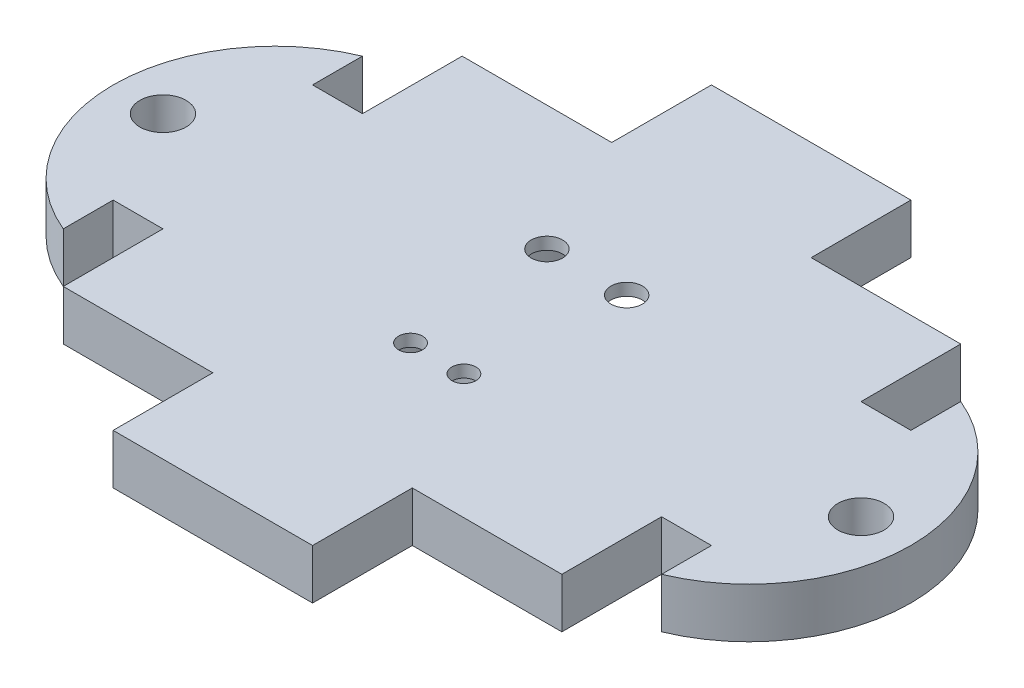
ISO-10303-21;
HEADER;
FILE_DESCRIPTION(('STEP AP214'),'2;1');
FILE_NAME('part.step','',(''),(''),'','','');
FILE_SCHEMA(('AUTOMOTIVE_DESIGN { 1 0 10303 214 1 1 1 1 }'));
ENDSEC;
DATA;
#1=APPLICATION_CONTEXT('core data for automotive mechanical design processes');
#2=APPLICATION_PROTOCOL_DEFINITION('international standard','automotive_design',2000,#1);
#3=PRODUCT_CONTEXT('',#1,'mechanical');
#4=PRODUCT('Part','Part','',(#3));
#5=PRODUCT_RELATED_PRODUCT_CATEGORY('part','',(#4));
#6=PRODUCT_DEFINITION_FORMATION('','',#4);
#7=PRODUCT_DEFINITION_CONTEXT('part definition',#1,'design');
#8=PRODUCT_DEFINITION('design','',#6,#7);
#9=PRODUCT_DEFINITION_SHAPE('','',#8);
#10=(LENGTH_UNIT() NAMED_UNIT(*) SI_UNIT(.MILLI.,.METRE.));
#11=(NAMED_UNIT(*) PLANE_ANGLE_UNIT() SI_UNIT($,.RADIAN.));
#12=(NAMED_UNIT(*) SI_UNIT($,.STERADIAN.) SOLID_ANGLE_UNIT());
#13=UNCERTAINTY_MEASURE_WITH_UNIT(LENGTH_MEASURE(1.E-05),#10,'distance_accuracy_value','');
#14=(GEOMETRIC_REPRESENTATION_CONTEXT(3) GLOBAL_UNCERTAINTY_ASSIGNED_CONTEXT((#13)) GLOBAL_UNIT_ASSIGNED_CONTEXT((#10,
#11,#12)) REPRESENTATION_CONTEXT('',''));
#15=CARTESIAN_POINT('',(0.,0.,0.));
#16=DIRECTION('',(0.,0.,1.));
#17=DIRECTION('',(1.,0.,0.));
#18=AXIS2_PLACEMENT_3D('',#15,#16,#17);
#19=CARTESIAN_POINT('',(15.08125,0.,0.));
#20=DIRECTION('',(0.,-1.,0.));
#21=DIRECTION('',(0.,0.,-1.));
#22=AXIS2_PLACEMENT_3D('',#19,#20,#21);
#23=PLANE('',#22);
#24=CARTESIAN_POINT('',(0.,0.,4.7625));
#25=DIRECTION('',(0.,1.,0.));
#26=DIRECTION('',(0.,0.,1.));
#27=AXIS2_PLACEMENT_3D('',#24,#25,#26);
#28=CIRCLE('',#27,2.6035);
#29=CARTESIAN_POINT('',(0.,0.,7.366));
#30=VERTEX_POINT('',#29);
#31=EDGE_CURVE('E477',#30,#30,#28,.T.);
#32=ORIENTED_EDGE('',*,*,#31,.T.);
#33=EDGE_LOOP('',(#32));
#34=FACE_BOUND('',#33,.T.);
#35=CARTESIAN_POINT('',(22.225,0.,0.));
#36=DIRECTION('',(0.,-1.,0.));
#37=DIRECTION('',(0.,0.,-1.));
#38=AXIS2_PLACEMENT_3D('',#35,#36,#37);
#39=CIRCLE('',#38,1.47319999999999);
#40=CARTESIAN_POINT('',(22.225,0.,-1.47319999999999));
#41=VERTEX_POINT('',#40);
#42=EDGE_CURVE('E508',#41,#41,#39,.T.);
#43=ORIENTED_EDGE('',*,*,#42,.F.);
#44=EDGE_LOOP('',(#43));
#45=FACE_BOUND('',#44,.T.);
#46=CARTESIAN_POINT('',(-22.225,0.,0.));
#47=DIRECTION('',(0.,-1.,0.));
#48=DIRECTION('',(0.,0.,-1.));
#49=AXIS2_PLACEMENT_3D('',#46,#47,#48);
#50=CIRCLE('',#49,1.47319999999999);
#51=CARTESIAN_POINT('',(-22.225,0.,-1.47319999999999));
#52=VERTEX_POINT('',#51);
#53=EDGE_CURVE('E237',#52,#52,#50,.T.);
#54=ORIENTED_EDGE('',*,*,#53,.F.);
#55=EDGE_LOOP('',(#54));
#56=FACE_BOUND('',#55,.T.);
#57=DIRECTION('',(1.,0.,0.));
#58=VECTOR('',#57,1.);
#59=CARTESIAN_POINT('',(6.34999999999999,0.,12.7));
#60=LINE('',#59,#58);
#61=CARTESIAN_POINT('',(6.34999999999999,0.,12.7));
#62=VERTEX_POINT('',#61);
#63=CARTESIAN_POINT('',(15.875,0.,12.7));
#64=VERTEX_POINT('',#63);
#65=EDGE_CURVE('E233',#62,#64,#60,.T.);
#66=ORIENTED_EDGE('',*,*,#65,.F.);
#67=DIRECTION('',(0.,0.,-1.));
#68=VECTOR('',#67,1.);
#69=CARTESIAN_POINT('',(6.34999999999999,0.,12.7));
#70=LINE('',#69,#68);
#71=CARTESIAN_POINT('',(6.35,0.,19.05));
#72=VERTEX_POINT('',#71);
#73=EDGE_CURVE('E139',#72,#62,#70,.T.);
#74=ORIENTED_EDGE('',*,*,#73,.F.);
#75=DIRECTION('',(1.,0.,0.));
#76=VECTOR('',#75,1.);
#77=CARTESIAN_POINT('',(-6.34999999999999,0.,19.05));
#78=LINE('',#77,#76);
#79=CARTESIAN_POINT('',(-6.34999999999999,0.,19.05));
#80=VERTEX_POINT('',#79);
#81=EDGE_CURVE('E133',#80,#72,#78,.T.);
#82=ORIENTED_EDGE('',*,*,#81,.F.);
#83=DIRECTION('',(0.,0.,1.));
#84=VECTOR('',#83,1.);
#85=CARTESIAN_POINT('',(-6.34999999999999,0.,12.7));
#86=LINE('',#85,#84);
#87=CARTESIAN_POINT('',(-6.34999999999999,0.,12.7));
#88=VERTEX_POINT('',#87);
#89=EDGE_CURVE('E223',#88,#80,#86,.T.);
#90=ORIENTED_EDGE('',*,*,#89,.F.);
#91=DIRECTION('',(1.,0.,0.));
#92=VECTOR('',#91,1.);
#93=CARTESIAN_POINT('',(-15.875,0.,12.7));
#94=LINE('',#93,#92);
#95=CARTESIAN_POINT('',(-15.875,0.,12.7));
#96=VERTEX_POINT('',#95);
#97=EDGE_CURVE('E275',#96,#88,#94,.T.);
#98=ORIENTED_EDGE('',*,*,#97,.F.);
#99=DIRECTION('',(0.,0.,1.));
#100=VECTOR('',#99,1.);
#101=CARTESIAN_POINT('',(-15.875,0.,6.35));
#102=LINE('',#101,#100);
#103=CARTESIAN_POINT('',(-15.875,0.,6.35));
#104=VERTEX_POINT('',#103);
#105=EDGE_CURVE('E273',#104,#96,#102,.T.);
#106=ORIENTED_EDGE('',*,*,#105,.F.);
#107=DIRECTION('',(1.,0.,0.));
#108=VECTOR('',#107,1.);
#109=CARTESIAN_POINT('',(-15.875,0.,6.35));
#110=LINE('',#109,#108);
#111=CARTESIAN_POINT('',(-19.05,0.,6.35));
#112=VERTEX_POINT('',#111);
#113=EDGE_CURVE('E271',#112,#104,#110,.T.);
#114=ORIENTED_EDGE('',*,*,#113,.F.);
#115=DIRECTION('',(0.,0.,-1.));
#116=VECTOR('',#115,1.);
#117=CARTESIAN_POINT('',(-19.05,0.,6.35));
#118=LINE('',#117,#116);
#119=CARTESIAN_POINT('',(-19.05,0.,9.525));
#120=VERTEX_POINT('',#119);
#121=EDGE_CURVE('E269',#120,#112,#118,.T.);
#122=ORIENTED_EDGE('',*,*,#121,.F.);
#123=CARTESIAN_POINT('',(-15.08125,0.,0.));
#124=DIRECTION('',(0.,1.,0.));
#125=DIRECTION('',(0.,0.,1.));
#126=AXIS2_PLACEMENT_3D('',#123,#124,#125);
#127=CIRCLE('',#126,10.31875);
#128=CARTESIAN_POINT('',(-19.05,0.,-9.525));
#129=VERTEX_POINT('',#128);
#130=EDGE_CURVE('E267',#129,#120,#127,.T.);
#131=ORIENTED_EDGE('',*,*,#130,.F.);
#132=DIRECTION('',(0.,0.,-1.));
#133=VECTOR('',#132,1.);
#134=CARTESIAN_POINT('',(-19.05,0.,-6.35));
#135=LINE('',#134,#133);
#136=CARTESIAN_POINT('',(-19.05,0.,-6.35));
#137=VERTEX_POINT('',#136);
#138=EDGE_CURVE('E265',#137,#129,#135,.T.);
#139=ORIENTED_EDGE('',*,*,#138,.F.);
#140=DIRECTION('',(-1.,0.,0.));
#141=VECTOR('',#140,1.);
#142=CARTESIAN_POINT('',(-15.875,0.,-6.35));
#143=LINE('',#142,#141);
#144=CARTESIAN_POINT('',(-15.875,0.,-6.35));
#145=VERTEX_POINT('',#144);
#146=EDGE_CURVE('E263',#145,#137,#143,.T.);
#147=ORIENTED_EDGE('',*,*,#146,.F.);
#148=DIRECTION('',(0.,0.,1.));
#149=VECTOR('',#148,1.);
#150=CARTESIAN_POINT('',(-15.875,0.,-12.7));
#151=LINE('',#150,#149);
#152=CARTESIAN_POINT('',(-15.875,0.,-12.7));
#153=VERTEX_POINT('',#152);
#154=EDGE_CURVE('E261',#153,#145,#151,.T.);
#155=ORIENTED_EDGE('',*,*,#154,.F.);
#156=DIRECTION('',(-1.,0.,0.));
#157=VECTOR('',#156,1.);
#158=CARTESIAN_POINT('',(-15.875,0.,-12.7));
#159=LINE('',#158,#157);
#160=CARTESIAN_POINT('',(-6.34999999999999,0.,-12.7));
#161=VERTEX_POINT('',#160);
#162=EDGE_CURVE('E259',#161,#153,#159,.T.);
#163=ORIENTED_EDGE('',*,*,#162,.F.);
#164=DIRECTION('',(0.,0.,1.));
#165=VECTOR('',#164,1.);
#166=CARTESIAN_POINT('',(-6.34999999999999,0.,-12.7));
#167=LINE('',#166,#165);
#168=CARTESIAN_POINT('',(-6.34999999999999,0.,-19.05));
#169=VERTEX_POINT('',#168);
#170=EDGE_CURVE('E257',#169,#161,#167,.T.);
#171=ORIENTED_EDGE('',*,*,#170,.F.);
#172=DIRECTION('',(-1.,0.,0.));
#173=VECTOR('',#172,1.);
#174=CARTESIAN_POINT('',(-6.34999999999999,0.,-19.05));
#175=LINE('',#174,#173);
#176=CARTESIAN_POINT('',(6.35,0.,-19.05));
#177=VERTEX_POINT('',#176);
#178=EDGE_CURVE('E255',#177,#169,#175,.T.);
#179=ORIENTED_EDGE('',*,*,#178,.F.);
#180=DIRECTION('',(0.,0.,-1.));
#181=VECTOR('',#180,1.);
#182=CARTESIAN_POINT('',(6.34999999999999,0.,-12.7));
#183=LINE('',#182,#181);
#184=CARTESIAN_POINT('',(6.34999999999999,0.,-12.7));
#185=VERTEX_POINT('',#184);
#186=EDGE_CURVE('E253',#185,#177,#183,.T.);
#187=ORIENTED_EDGE('',*,*,#186,.F.);
#188=DIRECTION('',(-1.,0.,0.));
#189=VECTOR('',#188,1.);
#190=CARTESIAN_POINT('',(6.34999999999999,0.,-12.7));
#191=LINE('',#190,#189);
#192=CARTESIAN_POINT('',(15.875,0.,-12.7));
#193=VERTEX_POINT('',#192);
#194=EDGE_CURVE('E251',#193,#185,#191,.T.);
#195=ORIENTED_EDGE('',*,*,#194,.F.);
#196=DIRECTION('',(0.,0.,-1.));
#197=VECTOR('',#196,1.);
#198=CARTESIAN_POINT('',(15.875,0.,-12.7));
#199=LINE('',#198,#197);
#200=CARTESIAN_POINT('',(15.875,0.,-6.35));
#201=VERTEX_POINT('',#200);
#202=EDGE_CURVE('E249',#201,#193,#199,.T.);
#203=ORIENTED_EDGE('',*,*,#202,.F.);
#204=DIRECTION('',(-1.,0.,0.));
#205=VECTOR('',#204,1.);
#206=CARTESIAN_POINT('',(15.875,0.,-6.35));
#207=LINE('',#206,#205);
#208=CARTESIAN_POINT('',(19.05,0.,-6.35));
#209=VERTEX_POINT('',#208);
#210=EDGE_CURVE('E247',#209,#201,#207,.T.);
#211=ORIENTED_EDGE('',*,*,#210,.F.);
#212=DIRECTION('',(0.,0.,1.));
#213=VECTOR('',#212,1.);
#214=CARTESIAN_POINT('',(19.05,0.,-6.35));
#215=LINE('',#214,#213);
#216=CARTESIAN_POINT('',(19.05,0.,-9.525));
#217=VERTEX_POINT('',#216);
#218=EDGE_CURVE('E245',#217,#209,#215,.T.);
#219=ORIENTED_EDGE('',*,*,#218,.F.);
#220=CARTESIAN_POINT('',(15.08125,0.,0.));
#221=DIRECTION('',(0.,1.,0.));
#222=DIRECTION('',(0.,0.,-1.));
#223=AXIS2_PLACEMENT_3D('',#220,#221,#222);
#224=CIRCLE('',#223,10.31875);
#225=CARTESIAN_POINT('',(19.05,0.,9.525));
#226=VERTEX_POINT('',#225);
#227=EDGE_CURVE('E243',#226,#217,#224,.T.);
#228=ORIENTED_EDGE('',*,*,#227,.F.);
#229=DIRECTION('',(0.,0.,1.));
#230=VECTOR('',#229,1.);
#231=CARTESIAN_POINT('',(19.05,0.,6.35));
#232=LINE('',#231,#230);
#233=CARTESIAN_POINT('',(19.05,0.,6.35));
#234=VERTEX_POINT('',#233);
#235=EDGE_CURVE('E241',#234,#226,#232,.T.);
#236=ORIENTED_EDGE('',*,*,#235,.F.);
#237=DIRECTION('',(1.,0.,0.));
#238=VECTOR('',#237,1.);
#239=CARTESIAN_POINT('',(15.875,0.,6.35));
#240=LINE('',#239,#238);
#241=CARTESIAN_POINT('',(15.875,0.,6.35));
#242=VERTEX_POINT('',#241);
#243=EDGE_CURVE('E239',#242,#234,#240,.T.);
#244=ORIENTED_EDGE('',*,*,#243,.F.);
#245=DIRECTION('',(0.,0.,-1.));
#246=VECTOR('',#245,1.);
#247=CARTESIAN_POINT('',(15.875,0.,6.35));
#248=LINE('',#247,#246);
#249=EDGE_CURVE('E236',#64,#242,#248,.T.);
#250=ORIENTED_EDGE('',*,*,#249,.F.);
#251=EDGE_LOOP('',(#66,#74,#82,#90,#98,#106,#114,#122,#131,#139,#147,#155,#163,#171,#179,#187,
#195,#203,#211,#219,#228,#236,#244,#250));
#252=FACE_BOUND('',#251,.T.);
#253=CARTESIAN_POINT('',(0.,0.,-4.7625));
#254=DIRECTION('',(0.,1.,0.));
#255=DIRECTION('',(0.,0.,1.));
#256=AXIS2_PLACEMENT_3D('',#253,#254,#255);
#257=CIRCLE('',#256,5.08);
#258=CARTESIAN_POINT('',(0.,0.,0.3175));
#259=VERTEX_POINT('',#258);
#260=EDGE_CURVE('E472',#259,#259,#257,.T.);
#261=ORIENTED_EDGE('',*,*,#260,.T.);
#262=EDGE_LOOP('',(#261));
#263=FACE_BOUND('',#262,.T.);
#264=ADVANCED_FACE('F39',(#34,#45,#56,#252,#263),#23,.T.);
#265=CARTESIAN_POINT('',(15.08125,3.175,0.));
#266=DIRECTION('',(0.,-1.,0.));
#267=DIRECTION('',(0.,0.,-1.));
#268=AXIS2_PLACEMENT_3D('',#265,#266,#267);
#269=PLANE('',#268);
#270=CARTESIAN_POINT('',(2.54,3.175,-4.7625));
#271=DIRECTION('',(0.,-1.,0.));
#272=DIRECTION('',(0.,0.,-1.));
#273=AXIS2_PLACEMENT_3D('',#270,#271,#272);
#274=CIRCLE('',#273,1.);
#275=CARTESIAN_POINT('',(2.54,3.175,-5.7625));
#276=VERTEX_POINT('',#275);
#277=EDGE_CURVE('E496',#276,#276,#274,.T.);
#278=ORIENTED_EDGE('',*,*,#277,.T.);
#279=EDGE_LOOP('',(#278));
#280=FACE_BOUND('',#279,.T.);
#281=CARTESIAN_POINT('',(-1.7,3.175,4.7625));
#282=DIRECTION('',(0.,-1.,0.));
#283=DIRECTION('',(0.,0.,-1.));
#284=AXIS2_PLACEMENT_3D('',#281,#282,#283);
#285=CIRCLE('',#284,0.762);
#286=CARTESIAN_POINT('',(-1.7,3.175,4.0005));
#287=VERTEX_POINT('',#286);
#288=EDGE_CURVE('E502',#287,#287,#285,.T.);
#289=ORIENTED_EDGE('',*,*,#288,.T.);
#290=EDGE_LOOP('',(#289));
#291=FACE_BOUND('',#290,.T.);
#292=CARTESIAN_POINT('',(22.225,3.175,0.));
#293=DIRECTION('',(0.,1.,0.));
#294=DIRECTION('',(0.,0.,1.));
#295=AXIS2_PLACEMENT_3D('',#292,#293,#294);
#296=CIRCLE('',#295,1.47319999999999);
#297=CARTESIAN_POINT('',(22.225,3.175,1.47319999999999));
#298=VERTEX_POINT('',#297);
#299=EDGE_CURVE('E505',#298,#298,#296,.T.);
#300=ORIENTED_EDGE('',*,*,#299,.F.);
#301=EDGE_LOOP('',(#300));
#302=FACE_BOUND('',#301,.T.);
#303=CARTESIAN_POINT('',(-22.225,3.175,0.));
#304=DIRECTION('',(0.,1.,0.));
#305=DIRECTION('',(0.,0.,1.));
#306=AXIS2_PLACEMENT_3D('',#303,#304,#305);
#307=CIRCLE('',#306,1.47319999999999);
#308=CARTESIAN_POINT('',(-22.225,3.175,1.47319999999999));
#309=VERTEX_POINT('',#308);
#310=EDGE_CURVE('E511',#309,#309,#307,.T.);
#311=ORIENTED_EDGE('',*,*,#310,.F.);
#312=EDGE_LOOP('',(#311));
#313=FACE_BOUND('',#312,.T.);
#314=DIRECTION('',(1.,0.,0.));
#315=VECTOR('',#314,1.);
#316=CARTESIAN_POINT('',(6.34999999999999,3.175,12.7));
#317=LINE('',#316,#315);
#318=CARTESIAN_POINT('',(6.34999999999999,3.175,12.7));
#319=VERTEX_POINT('',#318);
#320=CARTESIAN_POINT('',(15.875,3.175,12.7));
#321=VERTEX_POINT('',#320);
#322=EDGE_CURVE('E280',#319,#321,#317,.T.);
#323=ORIENTED_EDGE('',*,*,#322,.T.);
#324=DIRECTION('',(0.,0.,-1.));
#325=VECTOR('',#324,1.);
#326=CARTESIAN_POINT('',(15.875,3.175,6.35));
#327=LINE('',#326,#325);
#328=CARTESIAN_POINT('',(15.875,3.175,6.35));
#329=VERTEX_POINT('',#328);
#330=EDGE_CURVE('E147',#321,#329,#327,.T.);
#331=ORIENTED_EDGE('',*,*,#330,.T.);
#332=DIRECTION('',(1.,0.,0.));
#333=VECTOR('',#332,1.);
#334=CARTESIAN_POINT('',(15.875,3.175,6.35));
#335=LINE('',#334,#333);
#336=CARTESIAN_POINT('',(19.05,3.175,6.35));
#337=VERTEX_POINT('',#336);
#338=EDGE_CURVE('E343',#329,#337,#335,.T.);
#339=ORIENTED_EDGE('',*,*,#338,.T.);
#340=DIRECTION('',(0.,0.,1.));
#341=VECTOR('',#340,1.);
#342=CARTESIAN_POINT('',(19.05,3.175,6.35));
#343=LINE('',#342,#341);
#344=CARTESIAN_POINT('',(19.05,3.175,9.525));
#345=VERTEX_POINT('',#344);
#346=EDGE_CURVE('E361',#337,#345,#343,.T.);
#347=ORIENTED_EDGE('',*,*,#346,.T.);
#348=CARTESIAN_POINT('',(15.08125,3.175,0.));
#349=DIRECTION('',(0.,1.,0.));
#350=DIRECTION('',(0.,0.,-1.));
#351=AXIS2_PLACEMENT_3D('',#348,#349,#350);
#352=CIRCLE('',#351,10.31875);
#353=CARTESIAN_POINT('',(19.05,3.175,-9.525));
#354=VERTEX_POINT('',#353);
#355=EDGE_CURVE('E358',#345,#354,#352,.T.);
#356=ORIENTED_EDGE('',*,*,#355,.T.);
#357=DIRECTION('',(0.,0.,1.));
#358=VECTOR('',#357,1.);
#359=CARTESIAN_POINT('',(19.05,3.175,-6.35));
#360=LINE('',#359,#358);
#361=CARTESIAN_POINT('',(19.05,3.175,-6.35));
#362=VERTEX_POINT('',#361);
#363=EDGE_CURVE('E360',#354,#362,#360,.T.);
#364=ORIENTED_EDGE('',*,*,#363,.T.);
#365=DIRECTION('',(-1.,0.,0.));
#366=VECTOR('',#365,1.);
#367=CARTESIAN_POINT('',(15.875,3.175,-6.35));
#368=LINE('',#367,#366);
#369=CARTESIAN_POINT('',(15.875,3.175,-6.35));
#370=VERTEX_POINT('',#369);
#371=EDGE_CURVE('E363',#362,#370,#368,.T.);
#372=ORIENTED_EDGE('',*,*,#371,.T.);
#373=DIRECTION('',(0.,0.,-1.));
#374=VECTOR('',#373,1.);
#375=CARTESIAN_POINT('',(15.875,3.175,-12.7));
#376=LINE('',#375,#374);
#377=CARTESIAN_POINT('',(15.875,3.175,-12.7));
#378=VERTEX_POINT('',#377);
#379=EDGE_CURVE('E369',#370,#378,#376,.T.);
#380=ORIENTED_EDGE('',*,*,#379,.T.);
#381=DIRECTION('',(-1.,0.,0.));
#382=VECTOR('',#381,1.);
#383=CARTESIAN_POINT('',(6.34999999999999,3.175,-12.7));
#384=LINE('',#383,#382);
#385=CARTESIAN_POINT('',(6.34999999999999,3.175,-12.7));
#386=VERTEX_POINT('',#385);
#387=EDGE_CURVE('E371',#378,#386,#384,.T.);
#388=ORIENTED_EDGE('',*,*,#387,.T.);
#389=DIRECTION('',(0.,0.,-1.));
#390=VECTOR('',#389,1.);
#391=CARTESIAN_POINT('',(6.34999999999999,3.175,-12.7));
#392=LINE('',#391,#390);
#393=CARTESIAN_POINT('',(6.35,3.175,-19.05));
#394=VERTEX_POINT('',#393);
#395=EDGE_CURVE('E373',#386,#394,#392,.T.);
#396=ORIENTED_EDGE('',*,*,#395,.T.);
#397=DIRECTION('',(-1.,0.,0.));
#398=VECTOR('',#397,1.);
#399=CARTESIAN_POINT('',(-6.34999999999999,3.175,-19.05));
#400=LINE('',#399,#398);
#401=CARTESIAN_POINT('',(-6.34999999999999,3.175,-19.05));
#402=VERTEX_POINT('',#401);
#403=EDGE_CURVE('E375',#394,#402,#400,.T.);
#404=ORIENTED_EDGE('',*,*,#403,.T.);
#405=DIRECTION('',(0.,0.,1.));
#406=VECTOR('',#405,1.);
#407=CARTESIAN_POINT('',(-6.34999999999999,3.175,-12.7));
#408=LINE('',#407,#406);
#409=CARTESIAN_POINT('',(-6.34999999999999,3.175,-12.7));
#410=VERTEX_POINT('',#409);
#411=EDGE_CURVE('E377',#402,#410,#408,.T.);
#412=ORIENTED_EDGE('',*,*,#411,.T.);
#413=DIRECTION('',(-1.,0.,0.));
#414=VECTOR('',#413,1.);
#415=CARTESIAN_POINT('',(-15.875,3.175,-12.7));
#416=LINE('',#415,#414);
#417=CARTESIAN_POINT('',(-15.875,3.175,-12.7));
#418=VERTEX_POINT('',#417);
#419=EDGE_CURVE('E379',#410,#418,#416,.T.);
#420=ORIENTED_EDGE('',*,*,#419,.T.);
#421=DIRECTION('',(0.,0.,1.));
#422=VECTOR('',#421,1.);
#423=CARTESIAN_POINT('',(-15.875,3.175,-12.7));
#424=LINE('',#423,#422);
#425=CARTESIAN_POINT('',(-15.875,3.175,-6.35));
#426=VERTEX_POINT('',#425);
#427=EDGE_CURVE('E381',#418,#426,#424,.T.);
#428=ORIENTED_EDGE('',*,*,#427,.T.);
#429=DIRECTION('',(-1.,0.,0.));
#430=VECTOR('',#429,1.);
#431=CARTESIAN_POINT('',(-15.875,3.175,-6.35));
#432=LINE('',#431,#430);
#433=CARTESIAN_POINT('',(-19.05,3.175,-6.35));
#434=VERTEX_POINT('',#433);
#435=EDGE_CURVE('E383',#426,#434,#432,.T.);
#436=ORIENTED_EDGE('',*,*,#435,.T.);
#437=DIRECTION('',(0.,0.,-1.));
#438=VECTOR('',#437,1.);
#439=CARTESIAN_POINT('',(-19.05,3.175,-6.35));
#440=LINE('',#439,#438);
#441=CARTESIAN_POINT('',(-19.05,3.175,-9.525));
#442=VERTEX_POINT('',#441);
#443=EDGE_CURVE('E385',#434,#442,#440,.T.);
#444=ORIENTED_EDGE('',*,*,#443,.T.);
#445=CARTESIAN_POINT('',(-15.08125,3.175,0.));
#446=DIRECTION('',(0.,1.,0.));
#447=DIRECTION('',(0.,0.,1.));
#448=AXIS2_PLACEMENT_3D('',#445,#446,#447);
#449=CIRCLE('',#448,10.31875);
#450=CARTESIAN_POINT('',(-19.05,3.175,9.525));
#451=VERTEX_POINT('',#450);
#452=EDGE_CURVE('E387',#442,#451,#449,.T.);
#453=ORIENTED_EDGE('',*,*,#452,.T.);
#454=DIRECTION('',(0.,0.,-1.));
#455=VECTOR('',#454,1.);
#456=CARTESIAN_POINT('',(-19.05,3.175,6.35));
#457=LINE('',#456,#455);
#458=CARTESIAN_POINT('',(-19.05,3.175,6.35));
#459=VERTEX_POINT('',#458);
#460=EDGE_CURVE('E389',#451,#459,#457,.T.);
#461=ORIENTED_EDGE('',*,*,#460,.T.);
#462=DIRECTION('',(1.,0.,0.));
#463=VECTOR('',#462,1.);
#464=CARTESIAN_POINT('',(-15.875,3.175,6.35));
#465=LINE('',#464,#463);
#466=CARTESIAN_POINT('',(-15.875,3.175,6.35));
#467=VERTEX_POINT('',#466);
#468=EDGE_CURVE('E391',#459,#467,#465,.T.);
#469=ORIENTED_EDGE('',*,*,#468,.T.);
#470=DIRECTION('',(0.,0.,1.));
#471=VECTOR('',#470,1.);
#472=CARTESIAN_POINT('',(-15.875,3.175,6.35));
#473=LINE('',#472,#471);
#474=CARTESIAN_POINT('',(-15.875,3.175,12.7));
#475=VERTEX_POINT('',#474);
#476=EDGE_CURVE('E393',#467,#475,#473,.T.);
#477=ORIENTED_EDGE('',*,*,#476,.T.);
#478=DIRECTION('',(1.,0.,0.));
#479=VECTOR('',#478,1.);
#480=CARTESIAN_POINT('',(-15.875,3.175,12.7));
#481=LINE('',#480,#479);
#482=CARTESIAN_POINT('',(-6.34999999999999,3.175,12.7));
#483=VERTEX_POINT('',#482);
#484=EDGE_CURVE('E215',#475,#483,#481,.T.);
#485=ORIENTED_EDGE('',*,*,#484,.T.);
#486=DIRECTION('',(0.,0.,1.));
#487=VECTOR('',#486,1.);
#488=CARTESIAN_POINT('',(-6.34999999999999,3.175,12.7));
#489=LINE('',#488,#487);
#490=CARTESIAN_POINT('',(-6.34999999999999,3.175,19.05));
#491=VERTEX_POINT('',#490);
#492=EDGE_CURVE('E208',#483,#491,#489,.T.);
#493=ORIENTED_EDGE('',*,*,#492,.T.);
#494=DIRECTION('',(1.,0.,0.));
#495=VECTOR('',#494,1.);
#496=CARTESIAN_POINT('',(-6.34999999999999,3.175,19.05));
#497=LINE('',#496,#495);
#498=CARTESIAN_POINT('',(6.35,3.175,19.05));
#499=VERTEX_POINT('',#498);
#500=EDGE_CURVE('E213',#491,#499,#497,.T.);
#501=ORIENTED_EDGE('',*,*,#500,.T.);
#502=DIRECTION('',(0.,0.,-1.));
#503=VECTOR('',#502,1.);
#504=CARTESIAN_POINT('',(6.34999999999999,3.175,12.7));
#505=LINE('',#504,#503);
#506=EDGE_CURVE('E56',#499,#319,#505,.T.);
#507=ORIENTED_EDGE('',*,*,#506,.T.);
#508=EDGE_LOOP('',(#323,#331,#339,#347,#356,#364,#372,#380,#388,#396,#404,#412,#420,#428,#436,
#444,#453,#461,#469,#477,#485,#493,#501,#507));
#509=FACE_BOUND('',#508,.T.);
#510=CARTESIAN_POINT('',(1.7,3.175,4.7625));
#511=DIRECTION('',(0.,-1.,0.));
#512=DIRECTION('',(0.,0.,-1.));
#513=AXIS2_PLACEMENT_3D('',#510,#511,#512);
#514=CIRCLE('',#513,0.762000000000001);
#515=CARTESIAN_POINT('',(1.7,3.175,4.0005));
#516=VERTEX_POINT('',#515);
#517=EDGE_CURVE('E499',#516,#516,#514,.T.);
#518=ORIENTED_EDGE('',*,*,#517,.T.);
#519=EDGE_LOOP('',(#518));
#520=FACE_BOUND('',#519,.T.);
#521=CARTESIAN_POINT('',(-2.54,3.175,-4.7625));
#522=DIRECTION('',(0.,-1.,0.));
#523=DIRECTION('',(0.,0.,-1.));
#524=AXIS2_PLACEMENT_3D('',#521,#522,#523);
#525=CIRCLE('',#524,1.);
#526=CARTESIAN_POINT('',(-2.54,3.175,-5.7625));
#527=VERTEX_POINT('',#526);
#528=EDGE_CURVE('E492',#527,#527,#525,.T.);
#529=ORIENTED_EDGE('',*,*,#528,.T.);
#530=EDGE_LOOP('',(#529));
#531=FACE_BOUND('',#530,.T.);
#532=ADVANCED_FACE('F210',(#280,#291,#302,#313,#509,#520,#531),#269,.F.);
#533=CARTESIAN_POINT('',(6.34999999999999,3.175,12.7));
#534=DIRECTION('',(0.,0.,-1.));
#535=DIRECTION('',(-1.,0.,0.));
#536=AXIS2_PLACEMENT_3D('',#533,#534,#535);
#537=PLANE('',#536);
#538=ORIENTED_EDGE('',*,*,#65,.T.);
#539=DIRECTION('',(0.,-1.,0.));
#540=VECTOR('',#539,1.);
#541=CARTESIAN_POINT('',(15.875,3.175,12.7));
#542=LINE('',#541,#540);
#543=EDGE_CURVE('E12',#321,#64,#542,.T.);
#544=ORIENTED_EDGE('',*,*,#543,.F.);
#545=ORIENTED_EDGE('',*,*,#322,.F.);
#546=DIRECTION('',(0.,-1.,0.));
#547=VECTOR('',#546,1.);
#548=CARTESIAN_POINT('',(6.34999999999999,3.175,12.7));
#549=LINE('',#548,#547);
#550=EDGE_CURVE('E229',#319,#62,#549,.T.);
#551=ORIENTED_EDGE('',*,*,#550,.T.);
#552=EDGE_LOOP('',(#538,#544,#545,#551));
#553=FACE_BOUND('',#552,.T.);
#554=ADVANCED_FACE('F41',(#553),#537,.F.);
#555=CARTESIAN_POINT('',(15.875,3.175,6.35));
#556=DIRECTION('',(-1.,0.,0.));
#557=DIRECTION('',(0.,0.,1.));
#558=AXIS2_PLACEMENT_3D('',#555,#556,#557);
#559=PLANE('',#558);
#560=ORIENTED_EDGE('',*,*,#249,.T.);
#561=DIRECTION('',(0.,-1.,0.));
#562=VECTOR('',#561,1.);
#563=CARTESIAN_POINT('',(15.875,3.175,6.35));
#564=LINE('',#563,#562);
#565=EDGE_CURVE('E48',#329,#242,#564,.T.);
#566=ORIENTED_EDGE('',*,*,#565,.F.);
#567=ORIENTED_EDGE('',*,*,#330,.F.);
#568=ORIENTED_EDGE('',*,*,#543,.T.);
#569=EDGE_LOOP('',(#560,#566,#567,#568));
#570=FACE_BOUND('',#569,.T.);
#571=ADVANCED_FACE('F783',(#570),#559,.F.);
#572=CARTESIAN_POINT('',(15.875,3.175,6.35));
#573=DIRECTION('',(0.,0.,-1.));
#574=DIRECTION('',(-1.,0.,0.));
#575=AXIS2_PLACEMENT_3D('',#572,#573,#574);
#576=PLANE('',#575);
#577=ORIENTED_EDGE('',*,*,#243,.T.);
#578=DIRECTION('',(0.,-1.,0.));
#579=VECTOR('',#578,1.);
#580=CARTESIAN_POINT('',(19.05,3.175,6.35));
#581=LINE('',#580,#579);
#582=EDGE_CURVE('E335',#337,#234,#581,.T.);
#583=ORIENTED_EDGE('',*,*,#582,.F.);
#584=ORIENTED_EDGE('',*,*,#338,.F.);
#585=ORIENTED_EDGE('',*,*,#565,.T.);
#586=EDGE_LOOP('',(#577,#583,#584,#585));
#587=FACE_BOUND('',#586,.T.);
#588=ADVANCED_FACE('F341',(#587),#576,.F.);
#589=CARTESIAN_POINT('',(19.05,3.175,6.35));
#590=DIRECTION('',(1.,0.,0.));
#591=DIRECTION('',(0.,0.,-1.));
#592=AXIS2_PLACEMENT_3D('',#589,#590,#591);
#593=PLANE('',#592);
#594=ORIENTED_EDGE('',*,*,#235,.T.);
#595=DIRECTION('',(0.,-1.,0.));
#596=VECTOR('',#595,1.);
#597=CARTESIAN_POINT('',(19.05,3.175,9.525));
#598=LINE('',#597,#596);
#599=EDGE_CURVE('E332',#345,#226,#598,.T.);
#600=ORIENTED_EDGE('',*,*,#599,.F.);
#601=ORIENTED_EDGE('',*,*,#346,.F.);
#602=ORIENTED_EDGE('',*,*,#582,.T.);
#603=EDGE_LOOP('',(#594,#600,#601,#602));
#604=FACE_BOUND('',#603,.T.);
#605=ADVANCED_FACE('F352',(#604),#593,.F.);
#606=CARTESIAN_POINT('',(15.08125,3.175,0.));
#607=DIRECTION('',(0.,-1.,0.));
#608=DIRECTION('',(0.,0.,-1.));
#609=AXIS2_PLACEMENT_3D('',#606,#607,#608);
#610=CYLINDRICAL_SURFACE('',#609,10.31875);
#611=ORIENTED_EDGE('',*,*,#227,.T.);
#612=DIRECTION('',(0.,-1.,0.));
#613=VECTOR('',#612,1.);
#614=CARTESIAN_POINT('',(19.05,3.175,-9.525));
#615=LINE('',#614,#613);
#616=EDGE_CURVE('E329',#354,#217,#615,.T.);
#617=ORIENTED_EDGE('',*,*,#616,.F.);
#618=ORIENTED_EDGE('',*,*,#355,.F.);
#619=ORIENTED_EDGE('',*,*,#599,.T.);
#620=EDGE_LOOP('',(#611,#617,#618,#619));
#621=FACE_BOUND('',#620,.T.);
#622=ADVANCED_FACE('F356',(#621),#610,.T.);
#623=CARTESIAN_POINT('',(19.05,3.175,-6.35));
#624=DIRECTION('',(1.,0.,0.));
#625=DIRECTION('',(0.,0.,-1.));
#626=AXIS2_PLACEMENT_3D('',#623,#624,#625);
#627=PLANE('',#626);
#628=ORIENTED_EDGE('',*,*,#218,.T.);
#629=DIRECTION('',(0.,-1.,0.));
#630=VECTOR('',#629,1.);
#631=CARTESIAN_POINT('',(19.05,3.175,-6.35));
#632=LINE('',#631,#630);
#633=EDGE_CURVE('E326',#362,#209,#632,.T.);
#634=ORIENTED_EDGE('',*,*,#633,.F.);
#635=ORIENTED_EDGE('',*,*,#363,.F.);
#636=ORIENTED_EDGE('',*,*,#616,.T.);
#637=EDGE_LOOP('',(#628,#634,#635,#636));
#638=FACE_BOUND('',#637,.T.);
#639=ADVANCED_FACE('F752',(#638),#627,.F.);
#640=CARTESIAN_POINT('',(15.875,3.175,-6.35));
#641=DIRECTION('',(0.,0.,1.));
#642=DIRECTION('',(1.,0.,0.));
#643=AXIS2_PLACEMENT_3D('',#640,#641,#642);
#644=PLANE('',#643);
#645=ORIENTED_EDGE('',*,*,#210,.T.);
#646=DIRECTION('',(0.,-1.,0.));
#647=VECTOR('',#646,1.);
#648=CARTESIAN_POINT('',(15.875,3.175,-6.35));
#649=LINE('',#648,#647);
#650=EDGE_CURVE('E323',#370,#201,#649,.T.);
#651=ORIENTED_EDGE('',*,*,#650,.F.);
#652=ORIENTED_EDGE('',*,*,#371,.F.);
#653=ORIENTED_EDGE('',*,*,#633,.T.);
#654=EDGE_LOOP('',(#645,#651,#652,#653));
#655=FACE_BOUND('',#654,.T.);
#656=ADVANCED_FACE('F743',(#655),#644,.F.);
#657=CARTESIAN_POINT('',(15.875,3.175,-12.7));
#658=DIRECTION('',(-1.,0.,0.));
#659=DIRECTION('',(0.,0.,1.));
#660=AXIS2_PLACEMENT_3D('',#657,#658,#659);
#661=PLANE('',#660);
#662=ORIENTED_EDGE('',*,*,#202,.T.);
#663=DIRECTION('',(0.,-1.,0.));
#664=VECTOR('',#663,1.);
#665=CARTESIAN_POINT('',(15.875,3.175,-12.7));
#666=LINE('',#665,#664);
#667=EDGE_CURVE('E320',#378,#193,#666,.T.);
#668=ORIENTED_EDGE('',*,*,#667,.F.);
#669=ORIENTED_EDGE('',*,*,#379,.F.);
#670=ORIENTED_EDGE('',*,*,#650,.T.);
#671=EDGE_LOOP('',(#662,#668,#669,#670));
#672=FACE_BOUND('',#671,.T.);
#673=ADVANCED_FACE('F734',(#672),#661,.F.);
#674=CARTESIAN_POINT('',(6.34999999999999,3.175,-12.7));
#675=DIRECTION('',(0.,0.,1.));
#676=DIRECTION('',(1.,0.,0.));
#677=AXIS2_PLACEMENT_3D('',#674,#675,#676);
#678=PLANE('',#677);
#679=ORIENTED_EDGE('',*,*,#194,.T.);
#680=DIRECTION('',(0.,-1.,0.));
#681=VECTOR('',#680,1.);
#682=CARTESIAN_POINT('',(6.34999999999999,3.175,-12.7));
#683=LINE('',#682,#681);
#684=EDGE_CURVE('E317',#386,#185,#683,.T.);
#685=ORIENTED_EDGE('',*,*,#684,.F.);
#686=ORIENTED_EDGE('',*,*,#387,.F.);
#687=ORIENTED_EDGE('',*,*,#667,.T.);
#688=EDGE_LOOP('',(#679,#685,#686,#687));
#689=FACE_BOUND('',#688,.T.);
#690=ADVANCED_FACE('F725',(#689),#678,.F.);
#691=CARTESIAN_POINT('',(6.34999999999999,3.175,-12.7));
#692=DIRECTION('',(-1.,0.,0.));
#693=DIRECTION('',(0.,0.,1.));
#694=AXIS2_PLACEMENT_3D('',#691,#692,#693);
#695=PLANE('',#694);
#696=ORIENTED_EDGE('',*,*,#186,.T.);
#697=DIRECTION('',(0.,-1.,0.));
#698=VECTOR('',#697,1.);
#699=CARTESIAN_POINT('',(6.35,3.175,-19.05));
#700=LINE('',#699,#698);
#701=EDGE_CURVE('E314',#394,#177,#700,.T.);
#702=ORIENTED_EDGE('',*,*,#701,.F.);
#703=ORIENTED_EDGE('',*,*,#395,.F.);
#704=ORIENTED_EDGE('',*,*,#684,.T.);
#705=EDGE_LOOP('',(#696,#702,#703,#704));
#706=FACE_BOUND('',#705,.T.);
#707=ADVANCED_FACE('F716',(#706),#695,.F.);
#708=CARTESIAN_POINT('',(-6.34999999999999,3.175,-19.05));
#709=DIRECTION('',(0.,0.,1.));
#710=DIRECTION('',(1.,0.,0.));
#711=AXIS2_PLACEMENT_3D('',#708,#709,#710);
#712=PLANE('',#711);
#713=ORIENTED_EDGE('',*,*,#178,.T.);
#714=DIRECTION('',(0.,-1.,0.));
#715=VECTOR('',#714,1.);
#716=CARTESIAN_POINT('',(-6.34999999999999,3.175,-19.05));
#717=LINE('',#716,#715);
#718=EDGE_CURVE('E311',#402,#169,#717,.T.);
#719=ORIENTED_EDGE('',*,*,#718,.F.);
#720=ORIENTED_EDGE('',*,*,#403,.F.);
#721=ORIENTED_EDGE('',*,*,#701,.T.);
#722=EDGE_LOOP('',(#713,#719,#720,#721));
#723=FACE_BOUND('',#722,.T.);
#724=ADVANCED_FACE('F707',(#723),#712,.F.);
#725=CARTESIAN_POINT('',(-6.34999999999999,3.175,-12.7));
#726=DIRECTION('',(1.,0.,0.));
#727=DIRECTION('',(0.,0.,-1.));
#728=AXIS2_PLACEMENT_3D('',#725,#726,#727);
#729=PLANE('',#728);
#730=ORIENTED_EDGE('',*,*,#170,.T.);
#731=DIRECTION('',(0.,-1.,0.));
#732=VECTOR('',#731,1.);
#733=CARTESIAN_POINT('',(-6.34999999999999,3.175,-12.7));
#734=LINE('',#733,#732);
#735=EDGE_CURVE('E308',#410,#161,#734,.T.);
#736=ORIENTED_EDGE('',*,*,#735,.F.);
#737=ORIENTED_EDGE('',*,*,#411,.F.);
#738=ORIENTED_EDGE('',*,*,#718,.T.);
#739=EDGE_LOOP('',(#730,#736,#737,#738));
#740=FACE_BOUND('',#739,.T.);
#741=ADVANCED_FACE('F698',(#740),#729,.F.);
#742=CARTESIAN_POINT('',(-15.875,3.175,-12.7));
#743=DIRECTION('',(0.,0.,1.));
#744=DIRECTION('',(1.,0.,0.));
#745=AXIS2_PLACEMENT_3D('',#742,#743,#744);
#746=PLANE('',#745);
#747=ORIENTED_EDGE('',*,*,#162,.T.);
#748=DIRECTION('',(0.,-1.,0.));
#749=VECTOR('',#748,1.);
#750=CARTESIAN_POINT('',(-15.875,3.175,-12.7));
#751=LINE('',#750,#749);
#752=EDGE_CURVE('E305',#418,#153,#751,.T.);
#753=ORIENTED_EDGE('',*,*,#752,.F.);
#754=ORIENTED_EDGE('',*,*,#419,.F.);
#755=ORIENTED_EDGE('',*,*,#735,.T.);
#756=EDGE_LOOP('',(#747,#753,#754,#755));
#757=FACE_BOUND('',#756,.T.);
#758=ADVANCED_FACE('F689',(#757),#746,.F.);
#759=CARTESIAN_POINT('',(-15.875,3.175,-12.7));
#760=DIRECTION('',(1.,0.,0.));
#761=DIRECTION('',(0.,0.,-1.));
#762=AXIS2_PLACEMENT_3D('',#759,#760,#761);
#763=PLANE('',#762);
#764=ORIENTED_EDGE('',*,*,#154,.T.);
#765=DIRECTION('',(0.,-1.,0.));
#766=VECTOR('',#765,1.);
#767=CARTESIAN_POINT('',(-15.875,3.175,-6.35));
#768=LINE('',#767,#766);
#769=EDGE_CURVE('E302',#426,#145,#768,.T.);
#770=ORIENTED_EDGE('',*,*,#769,.F.);
#771=ORIENTED_EDGE('',*,*,#427,.F.);
#772=ORIENTED_EDGE('',*,*,#752,.T.);
#773=EDGE_LOOP('',(#764,#770,#771,#772));
#774=FACE_BOUND('',#773,.T.);
#775=ADVANCED_FACE('F680',(#774),#763,.F.);
#776=CARTESIAN_POINT('',(-15.875,3.175,-6.35));
#777=DIRECTION('',(0.,0.,1.));
#778=DIRECTION('',(1.,0.,0.));
#779=AXIS2_PLACEMENT_3D('',#776,#777,#778);
#780=PLANE('',#779);
#781=ORIENTED_EDGE('',*,*,#146,.T.);
#782=DIRECTION('',(0.,-1.,0.));
#783=VECTOR('',#782,1.);
#784=CARTESIAN_POINT('',(-19.05,3.175,-6.35));
#785=LINE('',#784,#783);
#786=EDGE_CURVE('E299',#434,#137,#785,.T.);
#787=ORIENTED_EDGE('',*,*,#786,.F.);
#788=ORIENTED_EDGE('',*,*,#435,.F.);
#789=ORIENTED_EDGE('',*,*,#769,.T.);
#790=EDGE_LOOP('',(#781,#787,#788,#789));
#791=FACE_BOUND('',#790,.T.);
#792=ADVANCED_FACE('F671',(#791),#780,.F.);
#793=CARTESIAN_POINT('',(-19.05,3.175,-6.35));
#794=DIRECTION('',(-1.,0.,0.));
#795=DIRECTION('',(0.,0.,1.));
#796=AXIS2_PLACEMENT_3D('',#793,#794,#795);
#797=PLANE('',#796);
#798=ORIENTED_EDGE('',*,*,#138,.T.);
#799=DIRECTION('',(0.,-1.,0.));
#800=VECTOR('',#799,1.);
#801=CARTESIAN_POINT('',(-19.05,3.175,-9.525));
#802=LINE('',#801,#800);
#803=EDGE_CURVE('E296',#442,#129,#802,.T.);
#804=ORIENTED_EDGE('',*,*,#803,.F.);
#805=ORIENTED_EDGE('',*,*,#443,.F.);
#806=ORIENTED_EDGE('',*,*,#786,.T.);
#807=EDGE_LOOP('',(#798,#804,#805,#806));
#808=FACE_BOUND('',#807,.T.);
#809=ADVANCED_FACE('F662',(#808),#797,.F.);
#810=CARTESIAN_POINT('',(-15.08125,3.175,0.));
#811=DIRECTION('',(0.,-1.,0.));
#812=DIRECTION('',(0.,0.,-1.));
#813=AXIS2_PLACEMENT_3D('',#810,#811,#812);
#814=CYLINDRICAL_SURFACE('',#813,10.31875);
#815=ORIENTED_EDGE('',*,*,#130,.T.);
#816=DIRECTION('',(0.,-1.,0.));
#817=VECTOR('',#816,1.);
#818=CARTESIAN_POINT('',(-19.05,3.175,9.525));
#819=LINE('',#818,#817);
#820=EDGE_CURVE('E293',#451,#120,#819,.T.);
#821=ORIENTED_EDGE('',*,*,#820,.F.);
#822=ORIENTED_EDGE('',*,*,#452,.F.);
#823=ORIENTED_EDGE('',*,*,#803,.T.);
#824=EDGE_LOOP('',(#815,#821,#822,#823));
#825=FACE_BOUND('',#824,.T.);
#826=ADVANCED_FACE('F653',(#825),#814,.T.);
#827=CARTESIAN_POINT('',(-19.05,3.175,6.35));
#828=DIRECTION('',(-1.,0.,0.));
#829=DIRECTION('',(0.,0.,1.));
#830=AXIS2_PLACEMENT_3D('',#827,#828,#829);
#831=PLANE('',#830);
#832=ORIENTED_EDGE('',*,*,#121,.T.);
#833=DIRECTION('',(0.,-1.,0.));
#834=VECTOR('',#833,1.);
#835=CARTESIAN_POINT('',(-19.05,3.175,6.35));
#836=LINE('',#835,#834);
#837=EDGE_CURVE('E290',#459,#112,#836,.T.);
#838=ORIENTED_EDGE('',*,*,#837,.F.);
#839=ORIENTED_EDGE('',*,*,#460,.F.);
#840=ORIENTED_EDGE('',*,*,#820,.T.);
#841=EDGE_LOOP('',(#832,#838,#839,#840));
#842=FACE_BOUND('',#841,.T.);
#843=ADVANCED_FACE('F644',(#842),#831,.F.);
#844=CARTESIAN_POINT('',(-15.875,3.175,6.35));
#845=DIRECTION('',(0.,0.,-1.));
#846=DIRECTION('',(-1.,0.,0.));
#847=AXIS2_PLACEMENT_3D('',#844,#845,#846);
#848=PLANE('',#847);
#849=ORIENTED_EDGE('',*,*,#113,.T.);
#850=DIRECTION('',(0.,-1.,0.));
#851=VECTOR('',#850,1.);
#852=CARTESIAN_POINT('',(-15.875,3.175,6.35));
#853=LINE('',#852,#851);
#854=EDGE_CURVE('E287',#467,#104,#853,.T.);
#855=ORIENTED_EDGE('',*,*,#854,.F.);
#856=ORIENTED_EDGE('',*,*,#468,.F.);
#857=ORIENTED_EDGE('',*,*,#837,.T.);
#858=EDGE_LOOP('',(#849,#855,#856,#857));
#859=FACE_BOUND('',#858,.T.);
#860=ADVANCED_FACE('F636',(#859),#848,.F.);
#861=CARTESIAN_POINT('',(-15.875,3.175,6.35));
#862=DIRECTION('',(1.,0.,0.));
#863=DIRECTION('',(0.,0.,-1.));
#864=AXIS2_PLACEMENT_3D('',#861,#862,#863);
#865=PLANE('',#864);
#866=ORIENTED_EDGE('',*,*,#105,.T.);
#867=DIRECTION('',(0.,-1.,0.));
#868=VECTOR('',#867,1.);
#869=CARTESIAN_POINT('',(-15.875,3.175,12.7));
#870=LINE('',#869,#868);
#871=EDGE_CURVE('E284',#475,#96,#870,.T.);
#872=ORIENTED_EDGE('',*,*,#871,.F.);
#873=ORIENTED_EDGE('',*,*,#476,.F.);
#874=ORIENTED_EDGE('',*,*,#854,.T.);
#875=EDGE_LOOP('',(#866,#872,#873,#874));
#876=FACE_BOUND('',#875,.T.);
#877=ADVANCED_FACE('F399',(#876),#865,.F.);
#878=CARTESIAN_POINT('',(-15.875,3.175,12.7));
#879=DIRECTION('',(0.,0.,-1.));
#880=DIRECTION('',(-1.,0.,0.));
#881=AXIS2_PLACEMENT_3D('',#878,#879,#880);
#882=PLANE('',#881);
#883=ORIENTED_EDGE('',*,*,#97,.T.);
#884=DIRECTION('',(0.,-1.,0.));
#885=VECTOR('',#884,1.);
#886=CARTESIAN_POINT('',(-6.34999999999999,3.175,12.7));
#887=LINE('',#886,#885);
#888=EDGE_CURVE('E224',#483,#88,#887,.T.);
#889=ORIENTED_EDGE('',*,*,#888,.F.);
#890=ORIENTED_EDGE('',*,*,#484,.F.);
#891=ORIENTED_EDGE('',*,*,#871,.T.);
#892=EDGE_LOOP('',(#883,#889,#890,#891));
#893=FACE_BOUND('',#892,.T.);
#894=ADVANCED_FACE('F403',(#893),#882,.F.);
#895=CARTESIAN_POINT('',(-6.34999999999999,3.175,12.7));
#896=DIRECTION('',(1.,0.,0.));
#897=DIRECTION('',(0.,0.,-1.));
#898=AXIS2_PLACEMENT_3D('',#895,#896,#897);
#899=PLANE('',#898);
#900=ORIENTED_EDGE('',*,*,#89,.T.);
#901=DIRECTION('',(0.,-1.,0.));
#902=VECTOR('',#901,1.);
#903=CARTESIAN_POINT('',(-6.34999999999999,3.175,19.05));
#904=LINE('',#903,#902);
#905=EDGE_CURVE('E220',#491,#80,#904,.T.);
#906=ORIENTED_EDGE('',*,*,#905,.F.);
#907=ORIENTED_EDGE('',*,*,#492,.F.);
#908=ORIENTED_EDGE('',*,*,#888,.T.);
#909=EDGE_LOOP('',(#900,#906,#907,#908));
#910=FACE_BOUND('',#909,.T.);
#911=ADVANCED_FACE('F221',(#910),#899,.F.);
#912=CARTESIAN_POINT('',(-6.34999999999999,3.175,19.05));
#913=DIRECTION('',(0.,0.,-1.));
#914=DIRECTION('',(-1.,0.,0.));
#915=AXIS2_PLACEMENT_3D('',#912,#913,#914);
#916=PLANE('',#915);
#917=ORIENTED_EDGE('',*,*,#81,.T.);
#918=DIRECTION('',(0.,-1.,0.));
#919=VECTOR('',#918,1.);
#920=CARTESIAN_POINT('',(6.35,3.175,19.05));
#921=LINE('',#920,#919);
#922=EDGE_CURVE('E225',#499,#72,#921,.T.);
#923=ORIENTED_EDGE('',*,*,#922,.F.);
#924=ORIENTED_EDGE('',*,*,#500,.F.);
#925=ORIENTED_EDGE('',*,*,#905,.T.);
#926=EDGE_LOOP('',(#917,#923,#924,#925));
#927=FACE_BOUND('',#926,.T.);
#928=ADVANCED_FACE('F227',(#927),#916,.F.);
#929=CARTESIAN_POINT('',(6.34999999999999,3.175,12.7));
#930=DIRECTION('',(-1.,0.,0.));
#931=DIRECTION('',(0.,0.,1.));
#932=AXIS2_PLACEMENT_3D('',#929,#930,#931);
#933=PLANE('',#932);
#934=ORIENTED_EDGE('',*,*,#73,.T.);
#935=ORIENTED_EDGE('',*,*,#550,.F.);
#936=ORIENTED_EDGE('',*,*,#506,.F.);
#937=ORIENTED_EDGE('',*,*,#922,.T.);
#938=EDGE_LOOP('',(#934,#935,#936,#937));
#939=FACE_BOUND('',#938,.T.);
#940=ADVANCED_FACE('F407',(#939),#933,.F.);
#941=CARTESIAN_POINT('',(-22.225,3.175,0.));
#942=DIRECTION('',(0.,1.,0.));
#943=DIRECTION('',(0.,0.,1.));
#944=AXIS2_PLACEMENT_3D('',#941,#942,#943);
#945=CYLINDRICAL_SURFACE('',#944,1.47319999999999);
#946=ORIENTED_EDGE('',*,*,#53,.T.);
#947=EDGE_LOOP('',(#946));
#948=FACE_BOUND('',#947,.T.);
#949=ORIENTED_EDGE('',*,*,#310,.T.);
#950=EDGE_LOOP('',(#949));
#951=FACE_BOUND('',#950,.T.);
#952=ADVANCED_FACE('F409',(#948,#951),#945,.F.);
#953=CARTESIAN_POINT('',(22.225,3.175,0.));
#954=DIRECTION('',(0.,1.,0.));
#955=DIRECTION('',(0.,0.,1.));
#956=AXIS2_PLACEMENT_3D('',#953,#954,#955);
#957=CYLINDRICAL_SURFACE('',#956,1.47319999999999);
#958=ORIENTED_EDGE('',*,*,#42,.T.);
#959=EDGE_LOOP('',(#958));
#960=FACE_BOUND('',#959,.T.);
#961=ORIENTED_EDGE('',*,*,#299,.T.);
#962=EDGE_LOOP('',(#961));
#963=FACE_BOUND('',#962,.T.);
#964=ADVANCED_FACE('F415',(#960,#963),#957,.F.);
#965=CARTESIAN_POINT('',(-1.7,3.176,4.7625));
#966=DIRECTION('',(0.,-1.,0.));
#967=DIRECTION('',(0.,0.,-1.));
#968=AXIS2_PLACEMENT_3D('',#965,#966,#967);
#969=CYLINDRICAL_SURFACE('',#968,0.762);
#970=CARTESIAN_POINT('',(-1.7,2.4,4.7625));
#971=DIRECTION('',(0.,1.,0.));
#972=DIRECTION('',(0.,0.,1.));
#973=AXIS2_PLACEMENT_3D('',#970,#971,#972);
#974=CIRCLE('',#973,0.762);
#975=CARTESIAN_POINT('',(-1.7,2.4,5.5245));
#976=VERTEX_POINT('',#975);
#977=EDGE_CURVE('E486',#976,#976,#974,.T.);
#978=ORIENTED_EDGE('',*,*,#977,.F.);
#979=EDGE_LOOP('',(#978));
#980=FACE_BOUND('',#979,.T.);
#981=ORIENTED_EDGE('',*,*,#288,.F.);
#982=EDGE_LOOP('',(#981));
#983=FACE_BOUND('',#982,.T.);
#984=ADVANCED_FACE('F432',(#980,#983),#969,.F.);
#985=CARTESIAN_POINT('',(1.7,3.176,4.7625));
#986=DIRECTION('',(0.,-1.,0.));
#987=DIRECTION('',(0.,0.,-1.));
#988=AXIS2_PLACEMENT_3D('',#985,#986,#987);
#989=CYLINDRICAL_SURFACE('',#988,0.762000000000001);
#990=CARTESIAN_POINT('',(1.7,2.4,4.7625));
#991=DIRECTION('',(0.,1.,0.));
#992=DIRECTION('',(0.,0.,1.));
#993=AXIS2_PLACEMENT_3D('',#990,#991,#992);
#994=CIRCLE('',#993,0.762000000000001);
#995=CARTESIAN_POINT('',(1.7,2.4,5.5245));
#996=VERTEX_POINT('',#995);
#997=EDGE_CURVE('E473',#996,#996,#994,.T.);
#998=ORIENTED_EDGE('',*,*,#997,.F.);
#999=EDGE_LOOP('',(#998));
#1000=FACE_BOUND('',#999,.T.);
#1001=ORIENTED_EDGE('',*,*,#517,.F.);
#1002=EDGE_LOOP('',(#1001));
#1003=FACE_BOUND('',#1002,.T.);
#1004=ADVANCED_FACE('F436',(#1000,#1003),#989,.F.);
#1005=CARTESIAN_POINT('',(2.54,3.176,-4.7625));
#1006=DIRECTION('',(0.,-1.,0.));
#1007=DIRECTION('',(0.,0.,-1.));
#1008=AXIS2_PLACEMENT_3D('',#1005,#1006,#1007);
#1009=CYLINDRICAL_SURFACE('',#1008,1.);
#1010=CARTESIAN_POINT('',(2.54,2.4,-4.7625));
#1011=DIRECTION('',(0.,1.,0.));
#1012=DIRECTION('',(0.,0.,1.));
#1013=AXIS2_PLACEMENT_3D('',#1010,#1011,#1012);
#1014=CIRCLE('',#1013,1.);
#1015=CARTESIAN_POINT('',(2.54,2.4,-3.7625));
#1016=VERTEX_POINT('',#1015);
#1017=EDGE_CURVE('E474',#1016,#1016,#1014,.T.);
#1018=ORIENTED_EDGE('',*,*,#1017,.F.);
#1019=EDGE_LOOP('',(#1018));
#1020=FACE_BOUND('',#1019,.T.);
#1021=ORIENTED_EDGE('',*,*,#277,.F.);
#1022=EDGE_LOOP('',(#1021));
#1023=FACE_BOUND('',#1022,.T.);
#1024=ADVANCED_FACE('F440',(#1020,#1023),#1009,.F.);
#1025=CARTESIAN_POINT('',(-2.54,3.176,-4.7625));
#1026=DIRECTION('',(0.,-1.,0.));
#1027=DIRECTION('',(0.,0.,-1.));
#1028=AXIS2_PLACEMENT_3D('',#1025,#1026,#1027);
#1029=CYLINDRICAL_SURFACE('',#1028,1.);
#1030=CARTESIAN_POINT('',(-2.54,2.4,-4.7625));
#1031=DIRECTION('',(0.,1.,0.));
#1032=DIRECTION('',(0.,0.,1.));
#1033=AXIS2_PLACEMENT_3D('',#1030,#1031,#1032);
#1034=CIRCLE('',#1033,1.);
#1035=CARTESIAN_POINT('',(-2.54,2.4,-3.7625));
#1036=VERTEX_POINT('',#1035);
#1037=EDGE_CURVE('E480',#1036,#1036,#1034,.T.);
#1038=ORIENTED_EDGE('',*,*,#1037,.F.);
#1039=EDGE_LOOP('',(#1038));
#1040=FACE_BOUND('',#1039,.T.);
#1041=ORIENTED_EDGE('',*,*,#528,.F.);
#1042=EDGE_LOOP('',(#1041));
#1043=FACE_BOUND('',#1042,.T.);
#1044=ADVANCED_FACE('F444',(#1040,#1043),#1029,.F.);
#1045=CARTESIAN_POINT('',(0.,2.4,0.));
#1046=DIRECTION('',(0.,1.,0.));
#1047=DIRECTION('',(0.,0.,1.));
#1048=AXIS2_PLACEMENT_3D('',#1045,#1046,#1047);
#1049=PLANE('',#1048);
#1050=CARTESIAN_POINT('',(0.,2.4,4.7625));
#1051=DIRECTION('',(0.,1.,0.));
#1052=DIRECTION('',(0.,0.,1.));
#1053=AXIS2_PLACEMENT_3D('',#1050,#1051,#1052);
#1054=CIRCLE('',#1053,2.6035);
#1055=CARTESIAN_POINT('',(0.,2.4,7.366));
#1056=VERTEX_POINT('',#1055);
#1057=EDGE_CURVE('E489',#1056,#1056,#1054,.T.);
#1058=ORIENTED_EDGE('',*,*,#1057,.F.);
#1059=EDGE_LOOP('',(#1058));
#1060=FACE_BOUND('',#1059,.T.);
#1061=ORIENTED_EDGE('',*,*,#977,.T.);
#1062=EDGE_LOOP('',(#1061));
#1063=FACE_BOUND('',#1062,.T.);
#1064=ORIENTED_EDGE('',*,*,#997,.T.);
#1065=EDGE_LOOP('',(#1064));
#1066=FACE_BOUND('',#1065,.T.);
#1067=ADVANCED_FACE('F448',(#1060,#1063,#1066),#1049,.F.);
#1068=CARTESIAN_POINT('',(0.,2.4,4.7625));
#1069=DIRECTION('',(0.,-1.,0.));
#1070=DIRECTION('',(0.,0.,-1.));
#1071=AXIS2_PLACEMENT_3D('',#1068,#1069,#1070);
#1072=CYLINDRICAL_SURFACE('',#1071,2.6035);
#1073=ORIENTED_EDGE('',*,*,#1057,.T.);
#1074=EDGE_LOOP('',(#1073));
#1075=FACE_BOUND('',#1074,.T.);
#1076=ORIENTED_EDGE('',*,*,#31,.F.);
#1077=EDGE_LOOP('',(#1076));
#1078=FACE_BOUND('',#1077,.T.);
#1079=ADVANCED_FACE('F450',(#1075,#1078),#1072,.F.);
#1080=CARTESIAN_POINT('',(0.,2.4,-4.7625));
#1081=DIRECTION('',(0.,-1.,0.));
#1082=DIRECTION('',(0.,0.,-1.));
#1083=AXIS2_PLACEMENT_3D('',#1080,#1081,#1082);
#1084=CYLINDRICAL_SURFACE('',#1083,5.08);
#1085=CARTESIAN_POINT('',(0.,2.4,-4.7625));
#1086=DIRECTION('',(0.,1.,0.));
#1087=DIRECTION('',(0.,0.,1.));
#1088=AXIS2_PLACEMENT_3D('',#1085,#1086,#1087);
#1089=CIRCLE('',#1088,5.08);
#1090=CARTESIAN_POINT('',(0.,2.4,0.3175));
#1091=VERTEX_POINT('',#1090);
#1092=EDGE_CURVE('E469',#1091,#1091,#1089,.T.);
#1093=ORIENTED_EDGE('',*,*,#1092,.T.);
#1094=EDGE_LOOP('',(#1093));
#1095=FACE_BOUND('',#1094,.T.);
#1096=ORIENTED_EDGE('',*,*,#260,.F.);
#1097=EDGE_LOOP('',(#1096));
#1098=FACE_BOUND('',#1097,.T.);
#1099=ADVANCED_FACE('F453',(#1095,#1098),#1084,.F.);
#1100=CARTESIAN_POINT('',(0.,2.4,0.));
#1101=DIRECTION('',(0.,1.,0.));
#1102=DIRECTION('',(0.,0.,1.));
#1103=AXIS2_PLACEMENT_3D('',#1100,#1101,#1102);
#1104=PLANE('',#1103);
#1105=ORIENTED_EDGE('',*,*,#1017,.T.);
#1106=EDGE_LOOP('',(#1105));
#1107=FACE_BOUND('',#1106,.T.);
#1108=ORIENTED_EDGE('',*,*,#1037,.T.);
#1109=EDGE_LOOP('',(#1108));
#1110=FACE_BOUND('',#1109,.T.);
#1111=ORIENTED_EDGE('',*,*,#1092,.F.);
#1112=EDGE_LOOP('',(#1111));
#1113=FACE_BOUND('',#1112,.T.);
#1114=ADVANCED_FACE('F458',(#1107,#1110,#1113),#1104,.F.);
#1115=CLOSED_SHELL('',(#264,#532,#554,#571,#588,#605,#622,#639,#656,#673,#690,#707,#724,#741,
#758,#775,#792,#809,#826,#843,#860,#877,#894,#911,#928,#940,#952,#964,#984,#1004,#1024,#1044,
#1067,#1079,#1099,#1114));
#1116=MANIFOLD_SOLID_BREP('B2',#1115);
#1117=ADVANCED_BREP_SHAPE_REPRESENTATION('',(#18,#1116),#14);
#1118=SHAPE_DEFINITION_REPRESENTATION(#9,#1117);
ENDSEC;
END-ISO-10303-21;
